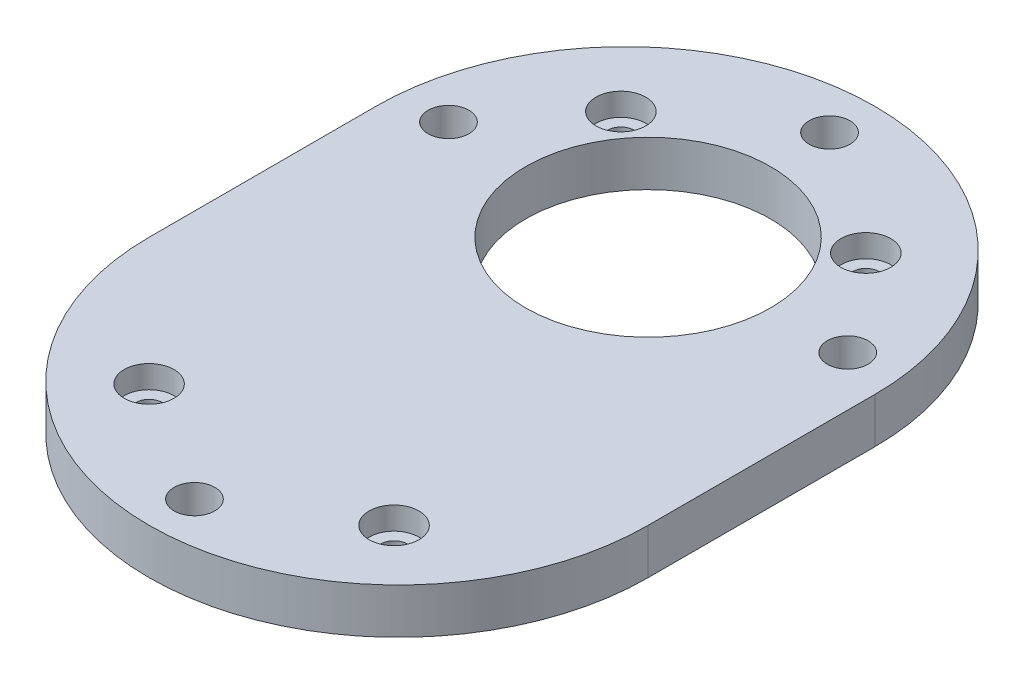
ISO-10303-21;
HEADER;
FILE_DESCRIPTION(('STEP AP214'),'2;1');
FILE_NAME('part.step','',(''),(''),'','','');
FILE_SCHEMA(('AUTOMOTIVE_DESIGN { 1 0 10303 214 1 1 1 1 }'));
ENDSEC;
DATA;
#1=APPLICATION_CONTEXT('core data for automotive mechanical design processes');
#2=APPLICATION_PROTOCOL_DEFINITION('international standard','automotive_design',2000,#1);
#3=PRODUCT_CONTEXT('',#1,'mechanical');
#4=PRODUCT('Part','Part','',(#3));
#5=PRODUCT_RELATED_PRODUCT_CATEGORY('part','',(#4));
#6=PRODUCT_DEFINITION_FORMATION('','',#4);
#7=PRODUCT_DEFINITION_CONTEXT('part definition',#1,'design');
#8=PRODUCT_DEFINITION('design','',#6,#7);
#9=PRODUCT_DEFINITION_SHAPE('','',#8);
#10=(LENGTH_UNIT() NAMED_UNIT(*) SI_UNIT(.MILLI.,.METRE.));
#11=(NAMED_UNIT(*) PLANE_ANGLE_UNIT() SI_UNIT($,.RADIAN.));
#12=(NAMED_UNIT(*) SI_UNIT($,.STERADIAN.) SOLID_ANGLE_UNIT());
#13=UNCERTAINTY_MEASURE_WITH_UNIT(LENGTH_MEASURE(1.E-05),#10,'distance_accuracy_value','');
#14=(GEOMETRIC_REPRESENTATION_CONTEXT(3) GLOBAL_UNCERTAINTY_ASSIGNED_CONTEXT((#13)) GLOBAL_UNIT_ASSIGNED_CONTEXT((#10,
#11,#12)) REPRESENTATION_CONTEXT('',''));
#15=CARTESIAN_POINT('',(0.,0.,0.));
#16=DIRECTION('',(0.,0.,1.));
#17=DIRECTION('',(1.,0.,0.));
#18=AXIS2_PLACEMENT_3D('',#15,#16,#17);
#19=CARTESIAN_POINT('',(0.,5.,10.));
#20=DIRECTION('',(0.,-1.,0.));
#21=DIRECTION('',(0.,0.,-1.));
#22=AXIS2_PLACEMENT_3D('',#19,#20,#21);
#23=CYLINDRICAL_SURFACE('',#22,27.5);
#24=CARTESIAN_POINT('',(0.,0.,10.));
#25=DIRECTION('',(0.,1.,0.));
#26=DIRECTION('',(0.,0.,1.));
#27=AXIS2_PLACEMENT_3D('',#24,#25,#26);
#28=CIRCLE('',#27,27.5);
#29=CARTESIAN_POINT('',(-27.5,0.,10.));
#30=VERTEX_POINT('',#29);
#31=CARTESIAN_POINT('',(27.5,0.,10.));
#32=VERTEX_POINT('',#31);
#33=EDGE_CURVE('E95',#30,#32,#28,.T.);
#34=ORIENTED_EDGE('',*,*,#33,.T.);
#35=DIRECTION('',(0.,-1.,0.));
#36=VECTOR('',#35,1.);
#37=CARTESIAN_POINT('',(27.5,5.,10.));
#38=LINE('',#37,#36);
#39=CARTESIAN_POINT('',(27.5,5.,10.));
#40=VERTEX_POINT('',#39);
#41=EDGE_CURVE('E11',#40,#32,#38,.T.);
#42=ORIENTED_EDGE('',*,*,#41,.F.);
#43=CARTESIAN_POINT('',(0.,5.,10.));
#44=DIRECTION('',(0.,1.,0.));
#45=DIRECTION('',(0.,0.,1.));
#46=AXIS2_PLACEMENT_3D('',#43,#44,#45);
#47=CIRCLE('',#46,27.5);
#48=CARTESIAN_POINT('',(-27.5,5.,10.));
#49=VERTEX_POINT('',#48);
#50=EDGE_CURVE('E83',#49,#40,#47,.T.);
#51=ORIENTED_EDGE('',*,*,#50,.F.);
#52=DIRECTION('',(0.,-1.,0.));
#53=VECTOR('',#52,1.);
#54=CARTESIAN_POINT('',(-27.5,5.,10.));
#55=LINE('',#54,#53);
#56=EDGE_CURVE('E91',#49,#30,#55,.T.);
#57=ORIENTED_EDGE('',*,*,#56,.T.);
#58=EDGE_LOOP('',(#34,#42,#51,#57));
#59=FACE_BOUND('',#58,.T.);
#60=ADVANCED_FACE('F32',(#59),#23,.T.);
#61=CARTESIAN_POINT('',(27.5,5.,-15.));
#62=DIRECTION('',(-1.,0.,0.));
#63=DIRECTION('',(0.,0.,1.));
#64=AXIS2_PLACEMENT_3D('',#61,#62,#63);
#65=PLANE('',#64);
#66=DIRECTION('',(0.,0.,-1.));
#67=VECTOR('',#66,1.);
#68=CARTESIAN_POINT('',(27.5,0.,-15.));
#69=LINE('',#68,#67);
#70=CARTESIAN_POINT('',(27.5,0.,-15.));
#71=VERTEX_POINT('',#70);
#72=EDGE_CURVE('E87',#32,#71,#69,.T.);
#73=ORIENTED_EDGE('',*,*,#72,.T.);
#74=DIRECTION('',(0.,-1.,0.));
#75=VECTOR('',#74,1.);
#76=CARTESIAN_POINT('',(27.5,5.,-15.));
#77=LINE('',#76,#75);
#78=CARTESIAN_POINT('',(27.5,5.,-15.));
#79=VERTEX_POINT('',#78);
#80=EDGE_CURVE('E40',#79,#71,#77,.T.);
#81=ORIENTED_EDGE('',*,*,#80,.F.);
#82=DIRECTION('',(0.,0.,-1.));
#83=VECTOR('',#82,1.);
#84=CARTESIAN_POINT('',(27.5,5.,-15.));
#85=LINE('',#84,#83);
#86=EDGE_CURVE('E78',#40,#79,#85,.T.);
#87=ORIENTED_EDGE('',*,*,#86,.F.);
#88=ORIENTED_EDGE('',*,*,#41,.T.);
#89=EDGE_LOOP('',(#73,#81,#87,#88));
#90=FACE_BOUND('',#89,.T.);
#91=ADVANCED_FACE('F86',(#90),#65,.F.);
#92=CARTESIAN_POINT('',(0.,5.,-15.));
#93=DIRECTION('',(0.,-1.,0.));
#94=DIRECTION('',(0.,0.,-1.));
#95=AXIS2_PLACEMENT_3D('',#92,#93,#94);
#96=CYLINDRICAL_SURFACE('',#95,27.5);
#97=CARTESIAN_POINT('',(0.,0.,-15.));
#98=DIRECTION('',(0.,1.,0.));
#99=DIRECTION('',(0.,0.,1.));
#100=AXIS2_PLACEMENT_3D('',#97,#98,#99);
#101=CIRCLE('',#100,27.5);
#102=CARTESIAN_POINT('',(-27.5,0.,-15.));
#103=VERTEX_POINT('',#102);
#104=EDGE_CURVE('E65',#71,#103,#101,.T.);
#105=ORIENTED_EDGE('',*,*,#104,.T.);
#106=DIRECTION('',(0.,-1.,0.));
#107=VECTOR('',#106,1.);
#108=CARTESIAN_POINT('',(-27.5,5.,-15.));
#109=LINE('',#108,#107);
#110=CARTESIAN_POINT('',(-27.5,5.,-15.));
#111=VERTEX_POINT('',#110);
#112=EDGE_CURVE('E88',#111,#103,#109,.T.);
#113=ORIENTED_EDGE('',*,*,#112,.F.);
#114=CARTESIAN_POINT('',(0.,5.,-15.));
#115=DIRECTION('',(0.,1.,0.));
#116=DIRECTION('',(0.,0.,1.));
#117=AXIS2_PLACEMENT_3D('',#114,#115,#116);
#118=CIRCLE('',#117,27.5);
#119=EDGE_CURVE('E81',#79,#111,#118,.T.);
#120=ORIENTED_EDGE('',*,*,#119,.F.);
#121=ORIENTED_EDGE('',*,*,#80,.T.);
#122=EDGE_LOOP('',(#105,#113,#120,#121));
#123=FACE_BOUND('',#122,.T.);
#124=ADVANCED_FACE('F89',(#123),#96,.T.);
#125=CARTESIAN_POINT('',(-27.5,5.,-15.));
#126=DIRECTION('',(1.,0.,0.));
#127=DIRECTION('',(0.,0.,-1.));
#128=AXIS2_PLACEMENT_3D('',#125,#126,#127);
#129=PLANE('',#128);
#130=DIRECTION('',(0.,0.,1.));
#131=VECTOR('',#130,1.);
#132=CARTESIAN_POINT('',(-27.5,0.,-15.));
#133=LINE('',#132,#131);
#134=EDGE_CURVE('E71',#103,#30,#133,.T.);
#135=ORIENTED_EDGE('',*,*,#134,.T.);
#136=ORIENTED_EDGE('',*,*,#56,.F.);
#137=DIRECTION('',(0.,0.,1.));
#138=VECTOR('',#137,1.);
#139=CARTESIAN_POINT('',(-27.5,5.,-15.));
#140=LINE('',#139,#138);
#141=EDGE_CURVE('E48',#111,#49,#140,.T.);
#142=ORIENTED_EDGE('',*,*,#141,.F.);
#143=ORIENTED_EDGE('',*,*,#112,.T.);
#144=EDGE_LOOP('',(#135,#136,#142,#143));
#145=FACE_BOUND('',#144,.T.);
#146=ADVANCED_FACE('F103',(#145),#129,.F.);
#147=CARTESIAN_POINT('',(0.,5.,10.));
#148=DIRECTION('',(0.,1.,0.));
#149=DIRECTION('',(0.,0.,1.));
#150=AXIS2_PLACEMENT_3D('',#147,#148,#149);
#151=PLANE('',#150);
#152=CARTESIAN_POINT('',(-13.5,5.,-28.));
#153=DIRECTION('',(0.,1.,0.));
#154=DIRECTION('',(0.,0.,1.));
#155=AXIS2_PLACEMENT_3D('',#152,#153,#154);
#156=CIRCLE('',#155,2.75);
#157=CARTESIAN_POINT('',(-13.5,5.,-25.25));
#158=VERTEX_POINT('',#157);
#159=EDGE_CURVE('E183',#158,#158,#156,.T.);
#160=ORIENTED_EDGE('',*,*,#159,.F.);
#161=EDGE_LOOP('',(#160));
#162=FACE_BOUND('',#161,.T.);
#163=CARTESIAN_POINT('',(13.5,5.,-28.));
#164=DIRECTION('',(0.,1.,0.));
#165=DIRECTION('',(0.,0.,1.));
#166=AXIS2_PLACEMENT_3D('',#163,#164,#165);
#167=CIRCLE('',#166,2.75);
#168=CARTESIAN_POINT('',(13.5,5.,-25.25));
#169=VERTEX_POINT('',#168);
#170=EDGE_CURVE('E171',#169,#169,#167,.T.);
#171=ORIENTED_EDGE('',*,*,#170,.F.);
#172=EDGE_LOOP('',(#171));
#173=FACE_BOUND('',#172,.T.);
#174=CARTESIAN_POINT('',(13.5,5.,24.));
#175=DIRECTION('',(0.,1.,0.));
#176=DIRECTION('',(0.,0.,1.));
#177=AXIS2_PLACEMENT_3D('',#174,#175,#176);
#178=CIRCLE('',#177,2.75);
#179=CARTESIAN_POINT('',(13.5,5.,26.75));
#180=VERTEX_POINT('',#179);
#181=EDGE_CURVE('E159',#180,#180,#178,.T.);
#182=ORIENTED_EDGE('',*,*,#181,.F.);
#183=EDGE_LOOP('',(#182));
#184=FACE_BOUND('',#183,.T.);
#185=CARTESIAN_POINT('',(-13.5,5.,24.));
#186=DIRECTION('',(0.,1.,0.));
#187=DIRECTION('',(0.,0.,1.));
#188=AXIS2_PLACEMENT_3D('',#185,#186,#187);
#189=CIRCLE('',#188,2.75);
#190=CARTESIAN_POINT('',(-13.5,5.,26.75));
#191=VERTEX_POINT('',#190);
#192=EDGE_CURVE('E147',#191,#191,#189,.T.);
#193=ORIENTED_EDGE('',*,*,#192,.F.);
#194=EDGE_LOOP('',(#193));
#195=FACE_BOUND('',#194,.T.);
#196=CARTESIAN_POINT('',(0.,5.,-37.5));
#197=DIRECTION('',(0.,1.,0.));
#198=DIRECTION('',(0.,0.,1.));
#199=AXIS2_PLACEMENT_3D('',#196,#197,#198);
#200=CIRCLE('',#199,2.25);
#201=CARTESIAN_POINT('',(0.,5.,-35.25));
#202=VERTEX_POINT('',#201);
#203=EDGE_CURVE('E134',#202,#202,#200,.T.);
#204=ORIENTED_EDGE('',*,*,#203,.F.);
#205=EDGE_LOOP('',(#204));
#206=FACE_BOUND('',#205,.T.);
#207=CARTESIAN_POINT('',(0.,5.,32.5));
#208=DIRECTION('',(0.,1.,0.));
#209=DIRECTION('',(0.,0.,1.));
#210=AXIS2_PLACEMENT_3D('',#207,#208,#209);
#211=CIRCLE('',#210,2.25);
#212=CARTESIAN_POINT('',(0.,5.,34.75));
#213=VERTEX_POINT('',#212);
#214=EDGE_CURVE('E128',#213,#213,#211,.T.);
#215=ORIENTED_EDGE('',*,*,#214,.F.);
#216=EDGE_LOOP('',(#215));
#217=FACE_BOUND('',#216,.T.);
#218=CARTESIAN_POINT('',(-22.,5.,-17.5));
#219=DIRECTION('',(0.,1.,0.));
#220=DIRECTION('',(0.,0.,1.));
#221=AXIS2_PLACEMENT_3D('',#218,#219,#220);
#222=CIRCLE('',#221,2.25);
#223=CARTESIAN_POINT('',(-22.,5.,-15.25));
#224=VERTEX_POINT('',#223);
#225=EDGE_CURVE('E122',#224,#224,#222,.T.);
#226=ORIENTED_EDGE('',*,*,#225,.F.);
#227=EDGE_LOOP('',(#226));
#228=FACE_BOUND('',#227,.T.);
#229=CARTESIAN_POINT('',(22.,5.,-17.5));
#230=DIRECTION('',(0.,1.,0.));
#231=DIRECTION('',(0.,0.,1.));
#232=AXIS2_PLACEMENT_3D('',#229,#230,#231);
#233=CIRCLE('',#232,2.25);
#234=CARTESIAN_POINT('',(22.,5.,-15.25));
#235=VERTEX_POINT('',#234);
#236=EDGE_CURVE('E115',#235,#235,#233,.T.);
#237=ORIENTED_EDGE('',*,*,#236,.F.);
#238=EDGE_LOOP('',(#237));
#239=FACE_BOUND('',#238,.T.);
#240=CARTESIAN_POINT('',(0.,5.,-17.5));
#241=DIRECTION('',(0.,1.,0.));
#242=DIRECTION('',(0.,0.,1.));
#243=AXIS2_PLACEMENT_3D('',#240,#241,#242);
#244=CIRCLE('',#243,13.5);
#245=CARTESIAN_POINT('',(0.,5.,-3.99999999999999));
#246=VERTEX_POINT('',#245);
#247=EDGE_CURVE('E109',#246,#246,#244,.T.);
#248=ORIENTED_EDGE('',*,*,#247,.F.);
#249=EDGE_LOOP('',(#248));
#250=FACE_BOUND('',#249,.T.);
#251=ORIENTED_EDGE('',*,*,#50,.T.);
#252=ORIENTED_EDGE('',*,*,#86,.T.);
#253=ORIENTED_EDGE('',*,*,#119,.T.);
#254=ORIENTED_EDGE('',*,*,#141,.T.);
#255=EDGE_LOOP('',(#251,#252,#253,#254));
#256=FACE_BOUND('',#255,.T.);
#257=ADVANCED_FACE('F79',(#162,#173,#184,#195,#206,#217,#228,#239,#250,#256),#151,.T.);
#258=CARTESIAN_POINT('',(0.,0.,10.));
#259=DIRECTION('',(0.,1.,0.));
#260=DIRECTION('',(0.,0.,1.));
#261=AXIS2_PLACEMENT_3D('',#258,#259,#260);
#262=PLANE('',#261);
#263=CARTESIAN_POINT('',(-13.5,0.,-28.));
#264=DIRECTION('',(0.,1.,0.));
#265=DIRECTION('',(0.,0.,1.));
#266=AXIS2_PLACEMENT_3D('',#263,#264,#265);
#267=CIRCLE('',#266,1.45);
#268=CARTESIAN_POINT('',(-13.5,0.,-26.55));
#269=VERTEX_POINT('',#268);
#270=EDGE_CURVE('E174',#269,#269,#267,.T.);
#271=ORIENTED_EDGE('',*,*,#270,.T.);
#272=EDGE_LOOP('',(#271));
#273=FACE_BOUND('',#272,.T.);
#274=CARTESIAN_POINT('',(13.5,0.,-28.));
#275=DIRECTION('',(0.,1.,0.));
#276=DIRECTION('',(0.,0.,1.));
#277=AXIS2_PLACEMENT_3D('',#274,#275,#276);
#278=CIRCLE('',#277,1.45);
#279=CARTESIAN_POINT('',(13.5,0.,-26.55));
#280=VERTEX_POINT('',#279);
#281=EDGE_CURVE('E162',#280,#280,#278,.T.);
#282=ORIENTED_EDGE('',*,*,#281,.T.);
#283=EDGE_LOOP('',(#282));
#284=FACE_BOUND('',#283,.T.);
#285=CARTESIAN_POINT('',(13.5,0.,24.));
#286=DIRECTION('',(0.,1.,0.));
#287=DIRECTION('',(0.,0.,1.));
#288=AXIS2_PLACEMENT_3D('',#285,#286,#287);
#289=CIRCLE('',#288,1.45);
#290=CARTESIAN_POINT('',(13.5,0.,25.45));
#291=VERTEX_POINT('',#290);
#292=EDGE_CURVE('E150',#291,#291,#289,.T.);
#293=ORIENTED_EDGE('',*,*,#292,.T.);
#294=EDGE_LOOP('',(#293));
#295=FACE_BOUND('',#294,.T.);
#296=CARTESIAN_POINT('',(-13.5,0.,24.));
#297=DIRECTION('',(0.,1.,0.));
#298=DIRECTION('',(0.,0.,1.));
#299=AXIS2_PLACEMENT_3D('',#296,#297,#298);
#300=CIRCLE('',#299,1.45);
#301=CARTESIAN_POINT('',(-13.5,0.,25.45));
#302=VERTEX_POINT('',#301);
#303=EDGE_CURVE('E119',#302,#302,#300,.T.);
#304=ORIENTED_EDGE('',*,*,#303,.T.);
#305=EDGE_LOOP('',(#304));
#306=FACE_BOUND('',#305,.T.);
#307=CARTESIAN_POINT('',(0.,0.,-37.5));
#308=DIRECTION('',(0.,1.,0.));
#309=DIRECTION('',(0.,0.,1.));
#310=AXIS2_PLACEMENT_3D('',#307,#308,#309);
#311=CIRCLE('',#310,2.25);
#312=CARTESIAN_POINT('',(0.,0.,-35.25));
#313=VERTEX_POINT('',#312);
#314=EDGE_CURVE('E112',#313,#313,#311,.T.);
#315=ORIENTED_EDGE('',*,*,#314,.T.);
#316=EDGE_LOOP('',(#315));
#317=FACE_BOUND('',#316,.T.);
#318=CARTESIAN_POINT('',(0.,0.,32.5));
#319=DIRECTION('',(0.,1.,0.));
#320=DIRECTION('',(0.,0.,1.));
#321=AXIS2_PLACEMENT_3D('',#318,#319,#320);
#322=CIRCLE('',#321,2.25);
#323=CARTESIAN_POINT('',(0.,0.,34.75));
#324=VERTEX_POINT('',#323);
#325=EDGE_CURVE('E131',#324,#324,#322,.T.);
#326=ORIENTED_EDGE('',*,*,#325,.T.);
#327=EDGE_LOOP('',(#326));
#328=FACE_BOUND('',#327,.T.);
#329=CARTESIAN_POINT('',(-22.,0.,-17.5));
#330=DIRECTION('',(0.,1.,0.));
#331=DIRECTION('',(0.,0.,1.));
#332=AXIS2_PLACEMENT_3D('',#329,#330,#331);
#333=CIRCLE('',#332,2.25);
#334=CARTESIAN_POINT('',(-22.,0.,-15.25));
#335=VERTEX_POINT('',#334);
#336=EDGE_CURVE('E125',#335,#335,#333,.T.);
#337=ORIENTED_EDGE('',*,*,#336,.T.);
#338=EDGE_LOOP('',(#337));
#339=FACE_BOUND('',#338,.T.);
#340=CARTESIAN_POINT('',(22.,0.,-17.5));
#341=DIRECTION('',(0.,1.,0.));
#342=DIRECTION('',(0.,0.,1.));
#343=AXIS2_PLACEMENT_3D('',#340,#341,#342);
#344=CIRCLE('',#343,2.25);
#345=CARTESIAN_POINT('',(22.,0.,-15.25));
#346=VERTEX_POINT('',#345);
#347=EDGE_CURVE('E118',#346,#346,#344,.T.);
#348=ORIENTED_EDGE('',*,*,#347,.T.);
#349=EDGE_LOOP('',(#348));
#350=FACE_BOUND('',#349,.T.);
#351=CARTESIAN_POINT('',(0.,0.,-17.5));
#352=DIRECTION('',(0.,1.,0.));
#353=DIRECTION('',(0.,0.,1.));
#354=AXIS2_PLACEMENT_3D('',#351,#352,#353);
#355=CIRCLE('',#354,13.5);
#356=CARTESIAN_POINT('',(0.,0.,-3.99999999999999));
#357=VERTEX_POINT('',#356);
#358=EDGE_CURVE('E98',#357,#357,#355,.T.);
#359=ORIENTED_EDGE('',*,*,#358,.T.);
#360=EDGE_LOOP('',(#359));
#361=FACE_BOUND('',#360,.T.);
#362=ORIENTED_EDGE('',*,*,#33,.F.);
#363=ORIENTED_EDGE('',*,*,#134,.F.);
#364=ORIENTED_EDGE('',*,*,#104,.F.);
#365=ORIENTED_EDGE('',*,*,#72,.F.);
#366=EDGE_LOOP('',(#362,#363,#364,#365));
#367=FACE_BOUND('',#366,.T.);
#368=ADVANCED_FACE('F106',(#273,#284,#295,#306,#317,#328,#339,#350,#361,#367),#262,.F.);
#369=CARTESIAN_POINT('',(0.,0.,-17.5));
#370=DIRECTION('',(0.,1.,0.));
#371=DIRECTION('',(0.,0.,1.));
#372=AXIS2_PLACEMENT_3D('',#369,#370,#371);
#373=CYLINDRICAL_SURFACE('',#372,13.5);
#374=ORIENTED_EDGE('',*,*,#358,.F.);
#375=EDGE_LOOP('',(#374));
#376=FACE_BOUND('',#375,.T.);
#377=ORIENTED_EDGE('',*,*,#247,.T.);
#378=EDGE_LOOP('',(#377));
#379=FACE_BOUND('',#378,.T.);
#380=ADVANCED_FACE('F208',(#376,#379),#373,.F.);
#381=CARTESIAN_POINT('',(22.,0.,-17.5));
#382=DIRECTION('',(0.,1.,0.));
#383=DIRECTION('',(0.,0.,1.));
#384=AXIS2_PLACEMENT_3D('',#381,#382,#383);
#385=CYLINDRICAL_SURFACE('',#384,2.25);
#386=ORIENTED_EDGE('',*,*,#347,.F.);
#387=EDGE_LOOP('',(#386));
#388=FACE_BOUND('',#387,.T.);
#389=ORIENTED_EDGE('',*,*,#236,.T.);
#390=EDGE_LOOP('',(#389));
#391=FACE_BOUND('',#390,.T.);
#392=ADVANCED_FACE('F210',(#388,#391),#385,.F.);
#393=CARTESIAN_POINT('',(-22.,0.,-17.5));
#394=DIRECTION('',(0.,1.,0.));
#395=DIRECTION('',(0.,0.,1.));
#396=AXIS2_PLACEMENT_3D('',#393,#394,#395);
#397=CYLINDRICAL_SURFACE('',#396,2.25);
#398=ORIENTED_EDGE('',*,*,#336,.F.);
#399=EDGE_LOOP('',(#398));
#400=FACE_BOUND('',#399,.T.);
#401=ORIENTED_EDGE('',*,*,#225,.T.);
#402=EDGE_LOOP('',(#401));
#403=FACE_BOUND('',#402,.T.);
#404=ADVANCED_FACE('F217',(#400,#403),#397,.F.);
#405=CARTESIAN_POINT('',(0.,0.,32.5));
#406=DIRECTION('',(0.,1.,0.));
#407=DIRECTION('',(0.,0.,1.));
#408=AXIS2_PLACEMENT_3D('',#405,#406,#407);
#409=CYLINDRICAL_SURFACE('',#408,2.25);
#410=ORIENTED_EDGE('',*,*,#325,.F.);
#411=EDGE_LOOP('',(#410));
#412=FACE_BOUND('',#411,.T.);
#413=ORIENTED_EDGE('',*,*,#214,.T.);
#414=EDGE_LOOP('',(#413));
#415=FACE_BOUND('',#414,.T.);
#416=ADVANCED_FACE('F376',(#412,#415),#409,.F.);
#417=CARTESIAN_POINT('',(0.,0.,-37.5));
#418=DIRECTION('',(0.,1.,0.));
#419=DIRECTION('',(0.,0.,1.));
#420=AXIS2_PLACEMENT_3D('',#417,#418,#419);
#421=CYLINDRICAL_SURFACE('',#420,2.25);
#422=ORIENTED_EDGE('',*,*,#314,.F.);
#423=EDGE_LOOP('',(#422));
#424=FACE_BOUND('',#423,.T.);
#425=ORIENTED_EDGE('',*,*,#203,.T.);
#426=EDGE_LOOP('',(#425));
#427=FACE_BOUND('',#426,.T.);
#428=ADVANCED_FACE('F258',(#424,#427),#421,.F.);
#429=CARTESIAN_POINT('',(-13.5,5.,24.));
#430=DIRECTION('',(0.,1.,0.));
#431=DIRECTION('',(0.,0.,1.));
#432=AXIS2_PLACEMENT_3D('',#429,#430,#431);
#433=CYLINDRICAL_SURFACE('',#432,1.45);
#434=ORIENTED_EDGE('',*,*,#303,.F.);
#435=EDGE_LOOP('',(#434));
#436=FACE_BOUND('',#435,.T.);
#437=CARTESIAN_POINT('',(-13.5,2.5,24.));
#438=DIRECTION('',(0.,1.,0.));
#439=DIRECTION('',(0.,0.,1.));
#440=AXIS2_PLACEMENT_3D('',#437,#438,#439);
#441=CIRCLE('',#440,1.45);
#442=CARTESIAN_POINT('',(-13.5,2.5,25.45));
#443=VERTEX_POINT('',#442);
#444=EDGE_CURVE('E141',#443,#443,#441,.T.);
#445=ORIENTED_EDGE('',*,*,#444,.T.);
#446=EDGE_LOOP('',(#445));
#447=FACE_BOUND('',#446,.T.);
#448=ADVANCED_FACE('F252',(#436,#447),#433,.F.);
#449=CARTESIAN_POINT('',(-12.05,2.5,24.));
#450=DIRECTION('',(0.,-1.,0.));
#451=DIRECTION('',(0.,0.,-1.));
#452=AXIS2_PLACEMENT_3D('',#449,#450,#451);
#453=PLANE('',#452);
#454=ORIENTED_EDGE('',*,*,#444,.F.);
#455=EDGE_LOOP('',(#454));
#456=FACE_BOUND('',#455,.T.);
#457=CARTESIAN_POINT('',(-13.5,2.5,24.));
#458=DIRECTION('',(0.,1.,0.));
#459=DIRECTION('',(0.,0.,1.));
#460=AXIS2_PLACEMENT_3D('',#457,#458,#459);
#461=CIRCLE('',#460,2.75);
#462=CARTESIAN_POINT('',(-13.5,2.5,26.75));
#463=VERTEX_POINT('',#462);
#464=EDGE_CURVE('E144',#463,#463,#461,.T.);
#465=ORIENTED_EDGE('',*,*,#464,.T.);
#466=EDGE_LOOP('',(#465));
#467=FACE_BOUND('',#466,.T.);
#468=ADVANCED_FACE('F257',(#456,#467),#453,.F.);
#469=CARTESIAN_POINT('',(-13.5,5.,24.));
#470=DIRECTION('',(0.,1.,0.));
#471=DIRECTION('',(0.,0.,1.));
#472=AXIS2_PLACEMENT_3D('',#469,#470,#471);
#473=CYLINDRICAL_SURFACE('',#472,2.75);
#474=ORIENTED_EDGE('',*,*,#464,.F.);
#475=EDGE_LOOP('',(#474));
#476=FACE_BOUND('',#475,.T.);
#477=ORIENTED_EDGE('',*,*,#192,.T.);
#478=EDGE_LOOP('',(#477));
#479=FACE_BOUND('',#478,.T.);
#480=ADVANCED_FACE('F270',(#476,#479),#473,.F.);
#481=CARTESIAN_POINT('',(13.5,5.,24.));
#482=DIRECTION('',(0.,1.,0.));
#483=DIRECTION('',(0.,0.,1.));
#484=AXIS2_PLACEMENT_3D('',#481,#482,#483);
#485=CYLINDRICAL_SURFACE('',#484,1.45);
#486=ORIENTED_EDGE('',*,*,#292,.F.);
#487=EDGE_LOOP('',(#486));
#488=FACE_BOUND('',#487,.T.);
#489=CARTESIAN_POINT('',(13.5,2.5,24.));
#490=DIRECTION('',(0.,1.,0.));
#491=DIRECTION('',(0.,0.,1.));
#492=AXIS2_PLACEMENT_3D('',#489,#490,#491);
#493=CIRCLE('',#492,1.45);
#494=CARTESIAN_POINT('',(13.5,2.5,25.45));
#495=VERTEX_POINT('',#494);
#496=EDGE_CURVE('E153',#495,#495,#493,.T.);
#497=ORIENTED_EDGE('',*,*,#496,.T.);
#498=EDGE_LOOP('',(#497));
#499=FACE_BOUND('',#498,.T.);
#500=ADVANCED_FACE('F280',(#488,#499),#485,.F.);
#501=CARTESIAN_POINT('',(14.95,2.5,24.));
#502=DIRECTION('',(0.,-1.,0.));
#503=DIRECTION('',(0.,0.,-1.));
#504=AXIS2_PLACEMENT_3D('',#501,#502,#503);
#505=PLANE('',#504);
#506=ORIENTED_EDGE('',*,*,#496,.F.);
#507=EDGE_LOOP('',(#506));
#508=FACE_BOUND('',#507,.T.);
#509=CARTESIAN_POINT('',(13.5,2.5,24.));
#510=DIRECTION('',(0.,1.,0.));
#511=DIRECTION('',(0.,0.,1.));
#512=AXIS2_PLACEMENT_3D('',#509,#510,#511);
#513=CIRCLE('',#512,2.75);
#514=CARTESIAN_POINT('',(13.5,2.5,26.75));
#515=VERTEX_POINT('',#514);
#516=EDGE_CURVE('E156',#515,#515,#513,.T.);
#517=ORIENTED_EDGE('',*,*,#516,.T.);
#518=EDGE_LOOP('',(#517));
#519=FACE_BOUND('',#518,.T.);
#520=ADVANCED_FACE('F290',(#508,#519),#505,.F.);
#521=CARTESIAN_POINT('',(13.5,5.,24.));
#522=DIRECTION('',(0.,1.,0.));
#523=DIRECTION('',(0.,0.,1.));
#524=AXIS2_PLACEMENT_3D('',#521,#522,#523);
#525=CYLINDRICAL_SURFACE('',#524,2.75);
#526=ORIENTED_EDGE('',*,*,#516,.F.);
#527=EDGE_LOOP('',(#526));
#528=FACE_BOUND('',#527,.T.);
#529=ORIENTED_EDGE('',*,*,#181,.T.);
#530=EDGE_LOOP('',(#529));
#531=FACE_BOUND('',#530,.T.);
#532=ADVANCED_FACE('F300',(#528,#531),#525,.F.);
#533=CARTESIAN_POINT('',(13.5,5.,-28.));
#534=DIRECTION('',(0.,1.,0.));
#535=DIRECTION('',(0.,0.,1.));
#536=AXIS2_PLACEMENT_3D('',#533,#534,#535);
#537=CYLINDRICAL_SURFACE('',#536,1.45);
#538=ORIENTED_EDGE('',*,*,#281,.F.);
#539=EDGE_LOOP('',(#538));
#540=FACE_BOUND('',#539,.T.);
#541=CARTESIAN_POINT('',(13.5,2.5,-28.));
#542=DIRECTION('',(0.,1.,0.));
#543=DIRECTION('',(0.,0.,1.));
#544=AXIS2_PLACEMENT_3D('',#541,#542,#543);
#545=CIRCLE('',#544,1.45);
#546=CARTESIAN_POINT('',(13.5,2.5,-26.55));
#547=VERTEX_POINT('',#546);
#548=EDGE_CURVE('E165',#547,#547,#545,.T.);
#549=ORIENTED_EDGE('',*,*,#548,.T.);
#550=EDGE_LOOP('',(#549));
#551=FACE_BOUND('',#550,.T.);
#552=ADVANCED_FACE('F310',(#540,#551),#537,.F.);
#553=CARTESIAN_POINT('',(14.95,2.5,-28.));
#554=DIRECTION('',(0.,-1.,0.));
#555=DIRECTION('',(0.,0.,-1.));
#556=AXIS2_PLACEMENT_3D('',#553,#554,#555);
#557=PLANE('',#556);
#558=ORIENTED_EDGE('',*,*,#548,.F.);
#559=EDGE_LOOP('',(#558));
#560=FACE_BOUND('',#559,.T.);
#561=CARTESIAN_POINT('',(13.5,2.5,-28.));
#562=DIRECTION('',(0.,1.,0.));
#563=DIRECTION('',(0.,0.,1.));
#564=AXIS2_PLACEMENT_3D('',#561,#562,#563);
#565=CIRCLE('',#564,2.75);
#566=CARTESIAN_POINT('',(13.5,2.5,-25.25));
#567=VERTEX_POINT('',#566);
#568=EDGE_CURVE('E168',#567,#567,#565,.T.);
#569=ORIENTED_EDGE('',*,*,#568,.T.);
#570=EDGE_LOOP('',(#569));
#571=FACE_BOUND('',#570,.T.);
#572=ADVANCED_FACE('F320',(#560,#571),#557,.F.);
#573=CARTESIAN_POINT('',(13.5,5.,-28.));
#574=DIRECTION('',(0.,1.,0.));
#575=DIRECTION('',(0.,0.,1.));
#576=AXIS2_PLACEMENT_3D('',#573,#574,#575);
#577=CYLINDRICAL_SURFACE('',#576,2.75);
#578=ORIENTED_EDGE('',*,*,#568,.F.);
#579=EDGE_LOOP('',(#578));
#580=FACE_BOUND('',#579,.T.);
#581=ORIENTED_EDGE('',*,*,#170,.T.);
#582=EDGE_LOOP('',(#581));
#583=FACE_BOUND('',#582,.T.);
#584=ADVANCED_FACE('F330',(#580,#583),#577,.F.);
#585=CARTESIAN_POINT('',(-13.5,5.,-28.));
#586=DIRECTION('',(0.,1.,0.));
#587=DIRECTION('',(0.,0.,1.));
#588=AXIS2_PLACEMENT_3D('',#585,#586,#587);
#589=CYLINDRICAL_SURFACE('',#588,1.45);
#590=ORIENTED_EDGE('',*,*,#270,.F.);
#591=EDGE_LOOP('',(#590));
#592=FACE_BOUND('',#591,.T.);
#593=CARTESIAN_POINT('',(-13.5,2.5,-28.));
#594=DIRECTION('',(0.,1.,0.));
#595=DIRECTION('',(0.,0.,1.));
#596=AXIS2_PLACEMENT_3D('',#593,#594,#595);
#597=CIRCLE('',#596,1.45);
#598=CARTESIAN_POINT('',(-13.5,2.5,-26.55));
#599=VERTEX_POINT('',#598);
#600=EDGE_CURVE('E177',#599,#599,#597,.T.);
#601=ORIENTED_EDGE('',*,*,#600,.T.);
#602=EDGE_LOOP('',(#601));
#603=FACE_BOUND('',#602,.T.);
#604=ADVANCED_FACE('F340',(#592,#603),#589,.F.);
#605=CARTESIAN_POINT('',(-12.05,2.5,-28.));
#606=DIRECTION('',(0.,-1.,0.));
#607=DIRECTION('',(0.,0.,-1.));
#608=AXIS2_PLACEMENT_3D('',#605,#606,#607);
#609=PLANE('',#608);
#610=ORIENTED_EDGE('',*,*,#600,.F.);
#611=EDGE_LOOP('',(#610));
#612=FACE_BOUND('',#611,.T.);
#613=CARTESIAN_POINT('',(-13.5,2.5,-28.));
#614=DIRECTION('',(0.,1.,0.));
#615=DIRECTION('',(0.,0.,1.));
#616=AXIS2_PLACEMENT_3D('',#613,#614,#615);
#617=CIRCLE('',#616,2.75);
#618=CARTESIAN_POINT('',(-13.5,2.5,-25.25));
#619=VERTEX_POINT('',#618);
#620=EDGE_CURVE('E180',#619,#619,#617,.T.);
#621=ORIENTED_EDGE('',*,*,#620,.T.);
#622=EDGE_LOOP('',(#621));
#623=FACE_BOUND('',#622,.T.);
#624=ADVANCED_FACE('F350',(#612,#623),#609,.F.);
#625=CARTESIAN_POINT('',(-13.5,5.,-28.));
#626=DIRECTION('',(0.,1.,0.));
#627=DIRECTION('',(0.,0.,1.));
#628=AXIS2_PLACEMENT_3D('',#625,#626,#627);
#629=CYLINDRICAL_SURFACE('',#628,2.75);
#630=ORIENTED_EDGE('',*,*,#620,.F.);
#631=EDGE_LOOP('',(#630));
#632=FACE_BOUND('',#631,.T.);
#633=ORIENTED_EDGE('',*,*,#159,.T.);
#634=EDGE_LOOP('',(#633));
#635=FACE_BOUND('',#634,.T.);
#636=ADVANCED_FACE('F187',(#632,#635),#629,.F.);
#637=CLOSED_SHELL('',(#60,#91,#124,#146,#257,#368,#380,#392,#404,#416,#428,#448,#468,#480,#500,
#520,#532,#552,#572,#584,#604,#624,#636));
#638=MANIFOLD_SOLID_BREP('B2',#637);
#639=ADVANCED_BREP_SHAPE_REPRESENTATION('',(#18,#638),#14);
#640=SHAPE_DEFINITION_REPRESENTATION(#9,#639);
ENDSEC;
END-ISO-10303-21;
